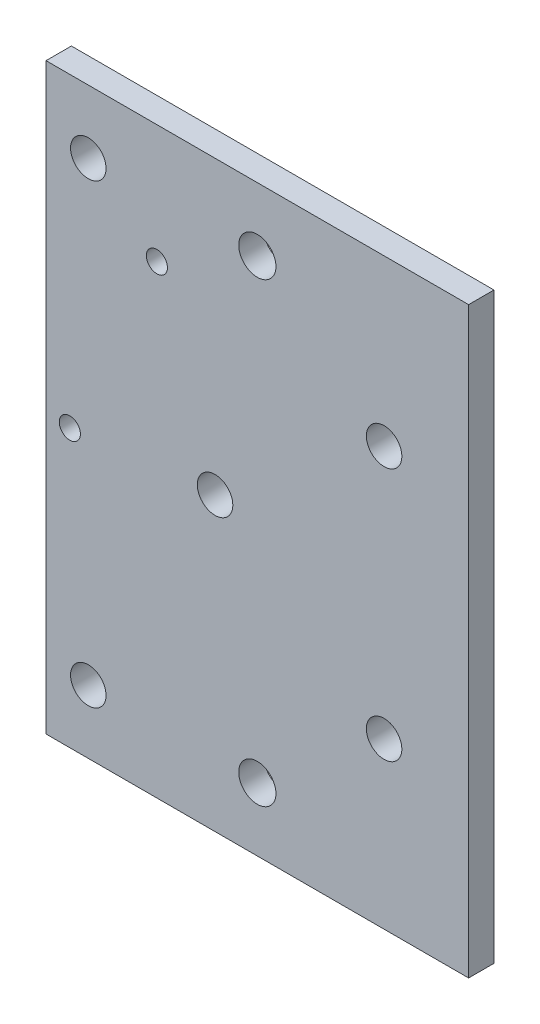
ISO-10303-21;
HEADER;
FILE_DESCRIPTION(('STEP AP214'),'2;1');
FILE_NAME('part.step','',(''),(''),'','','');
FILE_SCHEMA(('AUTOMOTIVE_DESIGN { 1 0 10303 214 1 1 1 1 }'));
ENDSEC;
DATA;
#1=APPLICATION_CONTEXT('core data for automotive mechanical design processes');
#2=APPLICATION_PROTOCOL_DEFINITION('international standard','automotive_design',2000,#1);
#3=PRODUCT_CONTEXT('',#1,'mechanical');
#4=PRODUCT('Part','Part','',(#3));
#5=PRODUCT_RELATED_PRODUCT_CATEGORY('part','',(#4));
#6=PRODUCT_DEFINITION_FORMATION('','',#4);
#7=PRODUCT_DEFINITION_CONTEXT('part definition',#1,'design');
#8=PRODUCT_DEFINITION('design','',#6,#7);
#9=PRODUCT_DEFINITION_SHAPE('','',#8);
#10=(LENGTH_UNIT() NAMED_UNIT(*) SI_UNIT(.MILLI.,.METRE.));
#11=(NAMED_UNIT(*) PLANE_ANGLE_UNIT() SI_UNIT($,.RADIAN.));
#12=(NAMED_UNIT(*) SI_UNIT($,.STERADIAN.) SOLID_ANGLE_UNIT());
#13=UNCERTAINTY_MEASURE_WITH_UNIT(LENGTH_MEASURE(1.E-05),#10,'distance_accuracy_value','');
#14=(GEOMETRIC_REPRESENTATION_CONTEXT(3) GLOBAL_UNCERTAINTY_ASSIGNED_CONTEXT((#13)) GLOBAL_UNIT_ASSIGNED_CONTEXT((#10,
#11,#12)) REPRESENTATION_CONTEXT('',''));
#15=CARTESIAN_POINT('',(0.,0.,0.));
#16=DIRECTION('',(0.,0.,1.));
#17=DIRECTION('',(1.,0.,0.));
#18=AXIS2_PLACEMENT_3D('',#15,#16,#17);
#19=CARTESIAN_POINT('',(0.,0.,3.));
#20=DIRECTION('',(0.,0.,1.));
#21=DIRECTION('',(1.,0.,0.));
#22=AXIS2_PLACEMENT_3D('',#19,#20,#21);
#23=PLANE('',#22);
#24=CARTESIAN_POINT('',(-25.,-27.,3.));
#25=DIRECTION('',(0.,0.,1.));
#26=DIRECTION('',(1.,0.,0.));
#27=AXIS2_PLACEMENT_3D('',#24,#25,#26);
#28=CIRCLE('',#27,2.1);
#29=CARTESIAN_POINT('',(-22.9,-27.,3.));
#30=VERTEX_POINT('',#29);
#31=EDGE_CURVE('E207',#30,#30,#28,.T.);
#32=ORIENTED_EDGE('',*,*,#31,.F.);
#33=EDGE_LOOP('',(#32));
#34=FACE_BOUND('',#33,.T.);
#35=CARTESIAN_POINT('',(-25.,27.,3.));
#36=DIRECTION('',(0.,0.,1.));
#37=DIRECTION('',(1.,0.,0.));
#38=AXIS2_PLACEMENT_3D('',#35,#36,#37);
#39=CIRCLE('',#38,2.1);
#40=CARTESIAN_POINT('',(-22.9,27.,3.));
#41=VERTEX_POINT('',#40);
#42=EDGE_CURVE('E211',#41,#41,#39,.T.);
#43=ORIENTED_EDGE('',*,*,#42,.F.);
#44=EDGE_LOOP('',(#43));
#45=FACE_BOUND('',#44,.T.);
#46=CARTESIAN_POINT('',(-16.8818880182161,20.46343837491,3.));
#47=DIRECTION('',(0.,0.,1.));
#48=DIRECTION('',(1.,0.,0.));
#49=AXIS2_PLACEMENT_3D('',#46,#47,#48);
#50=CIRCLE('',#49,1.24999999999999);
#51=CARTESIAN_POINT('',(-15.6318880182162,20.46343837491,3.));
#52=VERTEX_POINT('',#51);
#53=EDGE_CURVE('E220',#52,#52,#50,.T.);
#54=ORIENTED_EDGE('',*,*,#53,.F.);
#55=EDGE_LOOP('',(#54));
#56=FACE_BOUND('',#55,.T.);
#57=CARTESIAN_POINT('',(-27.1818880182186,-1.73656162508885,3.));
#58=DIRECTION('',(0.,0.,1.));
#59=DIRECTION('',(1.,0.,0.));
#60=AXIS2_PLACEMENT_3D('',#57,#58,#59);
#61=CIRCLE('',#60,1.24999999999999);
#62=CARTESIAN_POINT('',(-25.9318880182186,-1.73656162508885,3.));
#63=VERTEX_POINT('',#62);
#64=EDGE_CURVE('E226',#63,#63,#61,.T.);
#65=ORIENTED_EDGE('',*,*,#64,.F.);
#66=EDGE_LOOP('',(#65));
#67=FACE_BOUND('',#66,.T.);
#68=CARTESIAN_POINT('',(10.,-15.,3.));
#69=DIRECTION('',(0.,0.,1.));
#70=DIRECTION('',(1.,0.,0.));
#71=AXIS2_PLACEMENT_3D('',#68,#69,#70);
#72=CIRCLE('',#71,2.1);
#73=CARTESIAN_POINT('',(12.1,-15.,3.));
#74=VERTEX_POINT('',#73);
#75=EDGE_CURVE('E139',#74,#74,#72,.T.);
#76=ORIENTED_EDGE('',*,*,#75,.F.);
#77=EDGE_LOOP('',(#76));
#78=FACE_BOUND('',#77,.T.);
#79=CARTESIAN_POINT('',(10.,15.,3.));
#80=DIRECTION('',(0.,0.,1.));
#81=DIRECTION('',(1.,0.,0.));
#82=AXIS2_PLACEMENT_3D('',#79,#80,#81);
#83=CIRCLE('',#82,2.1);
#84=CARTESIAN_POINT('',(12.1,15.,3.));
#85=VERTEX_POINT('',#84);
#86=EDGE_CURVE('E134',#85,#85,#83,.T.);
#87=ORIENTED_EDGE('',*,*,#86,.F.);
#88=EDGE_LOOP('',(#87));
#89=FACE_BOUND('',#88,.T.);
#90=CARTESIAN_POINT('',(-9.99999999999999,0.,3.));
#91=DIRECTION('',(0.,0.,1.));
#92=DIRECTION('',(1.,0.,0.));
#93=AXIS2_PLACEMENT_3D('',#90,#91,#92);
#94=CIRCLE('',#93,2.1);
#95=CARTESIAN_POINT('',(-7.89999999999999,0.,3.));
#96=VERTEX_POINT('',#95);
#97=EDGE_CURVE('E142',#96,#96,#94,.T.);
#98=ORIENTED_EDGE('',*,*,#97,.F.);
#99=EDGE_LOOP('',(#98));
#100=FACE_BOUND('',#99,.T.);
#101=CARTESIAN_POINT('',(-5.,-27.,3.));
#102=DIRECTION('',(0.,0.,1.));
#103=DIRECTION('',(1.,0.,0.));
#104=AXIS2_PLACEMENT_3D('',#101,#102,#103);
#105=CIRCLE('',#104,2.2);
#106=CARTESIAN_POINT('',(-2.8,-27.,3.));
#107=VERTEX_POINT('',#106);
#108=EDGE_CURVE('E119',#107,#107,#105,.T.);
#109=ORIENTED_EDGE('',*,*,#108,.F.);
#110=EDGE_LOOP('',(#109));
#111=FACE_BOUND('',#110,.T.);
#112=CARTESIAN_POINT('',(-5.,27.,3.));
#113=DIRECTION('',(0.,0.,1.));
#114=DIRECTION('',(1.,0.,0.));
#115=AXIS2_PLACEMENT_3D('',#112,#113,#114);
#116=CIRCLE('',#115,2.2);
#117=CARTESIAN_POINT('',(-2.8,27.,3.));
#118=VERTEX_POINT('',#117);
#119=EDGE_CURVE('E108',#118,#118,#116,.T.);
#120=ORIENTED_EDGE('',*,*,#119,.F.);
#121=EDGE_LOOP('',(#120));
#122=FACE_BOUND('',#121,.T.);
#123=DIRECTION('',(1.,0.,0.));
#124=VECTOR('',#123,1.);
#125=CARTESIAN_POINT('',(-20.,34.5,3.));
#126=LINE('',#125,#124);
#127=CARTESIAN_POINT('',(-30.,34.5,3.));
#128=VERTEX_POINT('',#127);
#129=CARTESIAN_POINT('',(20.,34.5,3.));
#130=VERTEX_POINT('',#129);
#131=EDGE_CURVE('E92',#128,#130,#126,.T.);
#132=ORIENTED_EDGE('',*,*,#131,.F.);
#133=DIRECTION('',(0.,1.,0.));
#134=VECTOR('',#133,1.);
#135=CARTESIAN_POINT('',(-30.,-34.5,3.));
#136=LINE('',#135,#134);
#137=CARTESIAN_POINT('',(-30.,-34.5,3.));
#138=VERTEX_POINT('',#137);
#139=EDGE_CURVE('E78',#138,#128,#136,.T.);
#140=ORIENTED_EDGE('',*,*,#139,.F.);
#141=DIRECTION('',(-1.,0.,0.));
#142=VECTOR('',#141,1.);
#143=CARTESIAN_POINT('',(20.,-34.5,3.));
#144=LINE('',#143,#142);
#145=CARTESIAN_POINT('',(20.,-34.5,3.));
#146=VERTEX_POINT('',#145);
#147=EDGE_CURVE('E100',#146,#138,#144,.T.);
#148=ORIENTED_EDGE('',*,*,#147,.F.);
#149=DIRECTION('',(0.,1.,0.));
#150=VECTOR('',#149,1.);
#151=CARTESIAN_POINT('',(20.,14.5,3.));
#152=LINE('',#151,#150);
#153=EDGE_CURVE('E11',#146,#130,#152,.T.);
#154=ORIENTED_EDGE('',*,*,#153,.T.);
#155=EDGE_LOOP('',(#132,#140,#148,#154));
#156=FACE_BOUND('',#155,.T.);
#157=ADVANCED_FACE('F36',(#34,#45,#56,#67,#78,#89,#100,#111,#122,#156),#23,.T.);
#158=CARTESIAN_POINT('',(0.,0.,0.));
#159=DIRECTION('',(0.,0.,1.));
#160=DIRECTION('',(1.,0.,0.));
#161=AXIS2_PLACEMENT_3D('',#158,#159,#160);
#162=PLANE('',#161);
#163=CARTESIAN_POINT('',(-25.,-27.,0.));
#164=DIRECTION('',(0.,0.,-1.));
#165=DIRECTION('',(-1.,0.,0.));
#166=AXIS2_PLACEMENT_3D('',#163,#164,#165);
#167=CIRCLE('',#166,2.1);
#168=CARTESIAN_POINT('',(-27.1,-27.,0.));
#169=VERTEX_POINT('',#168);
#170=EDGE_CURVE('E210',#169,#169,#167,.T.);
#171=ORIENTED_EDGE('',*,*,#170,.F.);
#172=EDGE_LOOP('',(#171));
#173=FACE_BOUND('',#172,.T.);
#174=CARTESIAN_POINT('',(-25.,27.,0.));
#175=DIRECTION('',(0.,0.,-1.));
#176=DIRECTION('',(-1.,0.,0.));
#177=AXIS2_PLACEMENT_3D('',#174,#175,#176);
#178=CIRCLE('',#177,2.1);
#179=CARTESIAN_POINT('',(-27.1,27.,0.));
#180=VERTEX_POINT('',#179);
#181=EDGE_CURVE('E212',#180,#180,#178,.T.);
#182=ORIENTED_EDGE('',*,*,#181,.F.);
#183=EDGE_LOOP('',(#182));
#184=FACE_BOUND('',#183,.T.);
#185=CARTESIAN_POINT('',(-16.8818880182161,20.46343837491,0.));
#186=DIRECTION('',(0.,0.,1.));
#187=DIRECTION('',(1.,0.,0.));
#188=AXIS2_PLACEMENT_3D('',#185,#186,#187);
#189=CIRCLE('',#188,1.24999999999999);
#190=CARTESIAN_POINT('',(-15.6318880182162,20.46343837491,0.));
#191=VERTEX_POINT('',#190);
#192=EDGE_CURVE('E223',#191,#191,#189,.T.);
#193=ORIENTED_EDGE('',*,*,#192,.T.);
#194=EDGE_LOOP('',(#193));
#195=FACE_BOUND('',#194,.T.);
#196=CARTESIAN_POINT('',(-27.1818880182186,-1.73656162508885,0.));
#197=DIRECTION('',(0.,0.,1.));
#198=DIRECTION('',(1.,0.,0.));
#199=AXIS2_PLACEMENT_3D('',#196,#197,#198);
#200=CIRCLE('',#199,1.24999999999999);
#201=CARTESIAN_POINT('',(-25.9318880182186,-1.73656162508885,0.));
#202=VERTEX_POINT('',#201);
#203=EDGE_CURVE('E87',#202,#202,#200,.T.);
#204=ORIENTED_EDGE('',*,*,#203,.T.);
#205=EDGE_LOOP('',(#204));
#206=FACE_BOUND('',#205,.T.);
#207=CARTESIAN_POINT('',(-5.,27.,0.));
#208=DIRECTION('',(0.,0.,1.));
#209=DIRECTION('',(1.,0.,0.));
#210=AXIS2_PLACEMENT_3D('',#207,#208,#209);
#211=CIRCLE('',#210,2.2);
#212=CARTESIAN_POINT('',(-2.8,27.,0.));
#213=VERTEX_POINT('',#212);
#214=EDGE_CURVE('E105',#213,#213,#211,.T.);
#215=ORIENTED_EDGE('',*,*,#214,.T.);
#216=EDGE_LOOP('',(#215));
#217=FACE_BOUND('',#216,.T.);
#218=CARTESIAN_POINT('',(-5.,-27.,0.));
#219=DIRECTION('',(0.,0.,1.));
#220=DIRECTION('',(1.,0.,0.));
#221=AXIS2_PLACEMENT_3D('',#218,#219,#220);
#222=CIRCLE('',#221,2.2);
#223=CARTESIAN_POINT('',(-2.8,-27.,0.));
#224=VERTEX_POINT('',#223);
#225=EDGE_CURVE('E114',#224,#224,#222,.T.);
#226=ORIENTED_EDGE('',*,*,#225,.T.);
#227=EDGE_LOOP('',(#226));
#228=FACE_BOUND('',#227,.T.);
#229=CARTESIAN_POINT('',(-9.99999999999999,0.,0.));
#230=DIRECTION('',(0.,0.,1.));
#231=DIRECTION('',(1.,0.,0.));
#232=AXIS2_PLACEMENT_3D('',#229,#230,#231);
#233=CIRCLE('',#232,2.1);
#234=CARTESIAN_POINT('',(-7.89999999999999,0.,0.));
#235=VERTEX_POINT('',#234);
#236=EDGE_CURVE('E40',#235,#235,#233,.T.);
#237=ORIENTED_EDGE('',*,*,#236,.T.);
#238=EDGE_LOOP('',(#237));
#239=FACE_BOUND('',#238,.T.);
#240=CARTESIAN_POINT('',(10.,15.,0.));
#241=DIRECTION('',(0.,0.,-1.));
#242=DIRECTION('',(-1.,0.,0.));
#243=AXIS2_PLACEMENT_3D('',#240,#241,#242);
#244=CIRCLE('',#243,2.1);
#245=CARTESIAN_POINT('',(7.9,15.,0.));
#246=VERTEX_POINT('',#245);
#247=EDGE_CURVE('E128',#246,#246,#244,.T.);
#248=ORIENTED_EDGE('',*,*,#247,.F.);
#249=EDGE_LOOP('',(#248));
#250=FACE_BOUND('',#249,.T.);
#251=CARTESIAN_POINT('',(10.,-15.,0.));
#252=DIRECTION('',(0.,0.,-1.));
#253=DIRECTION('',(-1.,0.,0.));
#254=AXIS2_PLACEMENT_3D('',#251,#252,#253);
#255=CIRCLE('',#254,2.1);
#256=CARTESIAN_POINT('',(7.9,-15.,0.));
#257=VERTEX_POINT('',#256);
#258=EDGE_CURVE('E131',#257,#257,#255,.T.);
#259=ORIENTED_EDGE('',*,*,#258,.F.);
#260=EDGE_LOOP('',(#259));
#261=FACE_BOUND('',#260,.T.);
#262=DIRECTION('',(0.,-1.,0.));
#263=VECTOR('',#262,1.);
#264=CARTESIAN_POINT('',(-30.,-34.5,0.));
#265=LINE('',#264,#263);
#266=CARTESIAN_POINT('',(-30.,34.5,0.));
#267=VERTEX_POINT('',#266);
#268=CARTESIAN_POINT('',(-30.,-34.5,0.));
#269=VERTEX_POINT('',#268);
#270=EDGE_CURVE('E53',#267,#269,#265,.T.);
#271=ORIENTED_EDGE('',*,*,#270,.F.);
#272=DIRECTION('',(-1.,0.,0.));
#273=VECTOR('',#272,1.);
#274=CARTESIAN_POINT('',(-20.,34.5,0.));
#275=LINE('',#274,#273);
#276=CARTESIAN_POINT('',(20.,34.5,0.));
#277=VERTEX_POINT('',#276);
#278=EDGE_CURVE('E94',#277,#267,#275,.T.);
#279=ORIENTED_EDGE('',*,*,#278,.F.);
#280=DIRECTION('',(0.,1.,0.));
#281=VECTOR('',#280,1.);
#282=CARTESIAN_POINT('',(20.,14.5,0.));
#283=LINE('',#282,#281);
#284=CARTESIAN_POINT('',(20.,-34.5,0.));
#285=VERTEX_POINT('',#284);
#286=EDGE_CURVE('E45',#285,#277,#283,.T.);
#287=ORIENTED_EDGE('',*,*,#286,.F.);
#288=DIRECTION('',(1.,0.,0.));
#289=VECTOR('',#288,1.);
#290=CARTESIAN_POINT('',(20.,-34.5,0.));
#291=LINE('',#290,#289);
#292=EDGE_CURVE('E97',#269,#285,#291,.T.);
#293=ORIENTED_EDGE('',*,*,#292,.F.);
#294=EDGE_LOOP('',(#271,#279,#287,#293));
#295=FACE_BOUND('',#294,.T.);
#296=ADVANCED_FACE('F126',(#173,#184,#195,#206,#217,#228,#239,#250,#261,#295),#162,.F.);
#297=CARTESIAN_POINT('',(0.,34.5,0.));
#298=DIRECTION('',(0.,-1.,0.));
#299=DIRECTION('',(0.,0.,-1.));
#300=AXIS2_PLACEMENT_3D('',#297,#298,#299);
#301=PLANE('',#300);
#302=DIRECTION('',(0.,0.,-1.));
#303=VECTOR('',#302,1.);
#304=CARTESIAN_POINT('',(-30.,34.5,3.));
#305=LINE('',#304,#303);
#306=EDGE_CURVE('E81',#128,#267,#305,.T.);
#307=ORIENTED_EDGE('',*,*,#306,.F.);
#308=ORIENTED_EDGE('',*,*,#131,.T.);
#309=DIRECTION('',(0.,0.,-1.));
#310=VECTOR('',#309,1.);
#311=CARTESIAN_POINT('',(20.,34.5,3.));
#312=LINE('',#311,#310);
#313=EDGE_CURVE('E96',#130,#277,#312,.T.);
#314=ORIENTED_EDGE('',*,*,#313,.T.);
#315=ORIENTED_EDGE('',*,*,#278,.T.);
#316=EDGE_LOOP('',(#307,#308,#314,#315));
#317=FACE_BOUND('',#316,.T.);
#318=ADVANCED_FACE('F91',(#317),#301,.F.);
#319=CARTESIAN_POINT('',(0.,-34.5,0.));
#320=DIRECTION('',(0.,1.,0.));
#321=DIRECTION('',(0.,0.,1.));
#322=AXIS2_PLACEMENT_3D('',#319,#320,#321);
#323=PLANE('',#322);
#324=DIRECTION('',(0.,0.,1.));
#325=VECTOR('',#324,1.);
#326=CARTESIAN_POINT('',(-30.,-34.5,3.));
#327=LINE('',#326,#325);
#328=EDGE_CURVE('E82',#269,#138,#327,.T.);
#329=ORIENTED_EDGE('',*,*,#328,.F.);
#330=ORIENTED_EDGE('',*,*,#292,.T.);
#331=DIRECTION('',(0.,0.,1.));
#332=VECTOR('',#331,1.);
#333=CARTESIAN_POINT('',(20.,-34.5,3.));
#334=LINE('',#333,#332);
#335=EDGE_CURVE('E107',#285,#146,#334,.T.);
#336=ORIENTED_EDGE('',*,*,#335,.T.);
#337=ORIENTED_EDGE('',*,*,#147,.T.);
#338=EDGE_LOOP('',(#329,#330,#336,#337));
#339=FACE_BOUND('',#338,.T.);
#340=ADVANCED_FACE('F123',(#339),#323,.F.);
#341=CARTESIAN_POINT('',(20.,14.5,3.));
#342=DIRECTION('',(-1.,0.,0.));
#343=DIRECTION('',(0.,-1.,0.));
#344=AXIS2_PLACEMENT_3D('',#341,#342,#343);
#345=PLANE('',#344);
#346=ORIENTED_EDGE('',*,*,#286,.T.);
#347=ORIENTED_EDGE('',*,*,#313,.F.);
#348=ORIENTED_EDGE('',*,*,#153,.F.);
#349=ORIENTED_EDGE('',*,*,#335,.F.);
#350=EDGE_LOOP('',(#346,#347,#348,#349));
#351=FACE_BOUND('',#350,.T.);
#352=ADVANCED_FACE('F38',(#351),#345,.F.);
#353=CARTESIAN_POINT('',(-5.,27.,-12.));
#354=DIRECTION('',(0.,0.,1.));
#355=DIRECTION('',(1.,0.,0.));
#356=AXIS2_PLACEMENT_3D('',#353,#354,#355);
#357=CYLINDRICAL_SURFACE('',#356,2.2);
#358=ORIENTED_EDGE('',*,*,#119,.T.);
#359=EDGE_LOOP('',(#358));
#360=FACE_BOUND('',#359,.T.);
#361=ORIENTED_EDGE('',*,*,#214,.F.);
#362=EDGE_LOOP('',(#361));
#363=FACE_BOUND('',#362,.T.);
#364=ADVANCED_FACE('F169',(#360,#363),#357,.F.);
#365=CARTESIAN_POINT('',(-5.,-27.,0.));
#366=DIRECTION('',(0.,0.,1.));
#367=DIRECTION('',(1.,0.,0.));
#368=AXIS2_PLACEMENT_3D('',#365,#366,#367);
#369=CYLINDRICAL_SURFACE('',#368,2.2);
#370=ORIENTED_EDGE('',*,*,#225,.F.);
#371=EDGE_LOOP('',(#370));
#372=FACE_BOUND('',#371,.T.);
#373=ORIENTED_EDGE('',*,*,#108,.T.);
#374=EDGE_LOOP('',(#373));
#375=FACE_BOUND('',#374,.T.);
#376=ADVANCED_FACE('F152',(#372,#375),#369,.F.);
#377=CARTESIAN_POINT('',(-9.99999999999999,0.,-7.));
#378=DIRECTION('',(0.,0.,1.));
#379=DIRECTION('',(1.,0.,0.));
#380=AXIS2_PLACEMENT_3D('',#377,#378,#379);
#381=CYLINDRICAL_SURFACE('',#380,2.1);
#382=ORIENTED_EDGE('',*,*,#97,.T.);
#383=EDGE_LOOP('',(#382));
#384=FACE_BOUND('',#383,.T.);
#385=ORIENTED_EDGE('',*,*,#236,.F.);
#386=EDGE_LOOP('',(#385));
#387=FACE_BOUND('',#386,.T.);
#388=ADVANCED_FACE('F174',(#384,#387),#381,.F.);
#389=CARTESIAN_POINT('',(10.,15.,10.));
#390=DIRECTION('',(0.,0.,-1.));
#391=DIRECTION('',(-1.,0.,0.));
#392=AXIS2_PLACEMENT_3D('',#389,#390,#391);
#393=CYLINDRICAL_SURFACE('',#392,2.1);
#394=ORIENTED_EDGE('',*,*,#86,.T.);
#395=EDGE_LOOP('',(#394));
#396=FACE_BOUND('',#395,.T.);
#397=ORIENTED_EDGE('',*,*,#247,.T.);
#398=EDGE_LOOP('',(#397));
#399=FACE_BOUND('',#398,.T.);
#400=ADVANCED_FACE('F178',(#396,#399),#393,.F.);
#401=CARTESIAN_POINT('',(10.,-15.,10.));
#402=DIRECTION('',(0.,0.,-1.));
#403=DIRECTION('',(-1.,0.,0.));
#404=AXIS2_PLACEMENT_3D('',#401,#402,#403);
#405=CYLINDRICAL_SURFACE('',#404,2.1);
#406=ORIENTED_EDGE('',*,*,#75,.T.);
#407=EDGE_LOOP('',(#406));
#408=FACE_BOUND('',#407,.T.);
#409=ORIENTED_EDGE('',*,*,#258,.T.);
#410=EDGE_LOOP('',(#409));
#411=FACE_BOUND('',#410,.T.);
#412=ADVANCED_FACE('F181',(#408,#411),#405,.F.);
#413=CARTESIAN_POINT('',(-30.,0.,0.));
#414=DIRECTION('',(-1.,0.,0.));
#415=DIRECTION('',(0.,-1.,0.));
#416=AXIS2_PLACEMENT_3D('',#413,#414,#415);
#417=PLANE('',#416);
#418=ORIENTED_EDGE('',*,*,#139,.T.);
#419=ORIENTED_EDGE('',*,*,#306,.T.);
#420=ORIENTED_EDGE('',*,*,#270,.T.);
#421=ORIENTED_EDGE('',*,*,#328,.T.);
#422=EDGE_LOOP('',(#418,#419,#420,#421));
#423=FACE_BOUND('',#422,.T.);
#424=ADVANCED_FACE('F80',(#423),#417,.T.);
#425=CARTESIAN_POINT('',(-27.1818880182186,-1.73656162508885,3.));
#426=DIRECTION('',(0.,0.,1.));
#427=DIRECTION('',(1.,0.,0.));
#428=AXIS2_PLACEMENT_3D('',#425,#426,#427);
#429=CYLINDRICAL_SURFACE('',#428,1.24999999999999);
#430=ORIENTED_EDGE('',*,*,#64,.T.);
#431=EDGE_LOOP('',(#430));
#432=FACE_BOUND('',#431,.T.);
#433=ORIENTED_EDGE('',*,*,#203,.F.);
#434=EDGE_LOOP('',(#433));
#435=FACE_BOUND('',#434,.T.);
#436=ADVANCED_FACE('F188',(#432,#435),#429,.F.);
#437=CARTESIAN_POINT('',(-16.8818880182161,20.46343837491,3.));
#438=DIRECTION('',(0.,0.,1.));
#439=DIRECTION('',(1.,0.,0.));
#440=AXIS2_PLACEMENT_3D('',#437,#438,#439);
#441=CYLINDRICAL_SURFACE('',#440,1.24999999999999);
#442=ORIENTED_EDGE('',*,*,#53,.T.);
#443=EDGE_LOOP('',(#442));
#444=FACE_BOUND('',#443,.T.);
#445=ORIENTED_EDGE('',*,*,#192,.F.);
#446=EDGE_LOOP('',(#445));
#447=FACE_BOUND('',#446,.T.);
#448=ADVANCED_FACE('F191',(#444,#447),#441,.F.);
#449=CARTESIAN_POINT('',(-25.,27.,10.));
#450=DIRECTION('',(0.,0.,-1.));
#451=DIRECTION('',(-1.,0.,0.));
#452=AXIS2_PLACEMENT_3D('',#449,#450,#451);
#453=CYLINDRICAL_SURFACE('',#452,2.1);
#454=ORIENTED_EDGE('',*,*,#42,.T.);
#455=EDGE_LOOP('',(#454));
#456=FACE_BOUND('',#455,.T.);
#457=ORIENTED_EDGE('',*,*,#181,.T.);
#458=EDGE_LOOP('',(#457));
#459=FACE_BOUND('',#458,.T.);
#460=ADVANCED_FACE('F195',(#456,#459),#453,.F.);
#461=CARTESIAN_POINT('',(-25.,-27.,10.));
#462=DIRECTION('',(0.,0.,-1.));
#463=DIRECTION('',(-1.,0.,0.));
#464=AXIS2_PLACEMENT_3D('',#461,#462,#463);
#465=CYLINDRICAL_SURFACE('',#464,2.1);
#466=ORIENTED_EDGE('',*,*,#31,.T.);
#467=EDGE_LOOP('',(#466));
#468=FACE_BOUND('',#467,.T.);
#469=ORIENTED_EDGE('',*,*,#170,.T.);
#470=EDGE_LOOP('',(#469));
#471=FACE_BOUND('',#470,.T.);
#472=ADVANCED_FACE('F199',(#468,#471),#465,.F.);
#473=CLOSED_SHELL('',(#157,#296,#318,#340,#352,#364,#376,#388,#400,#412,#424,#436,#448,#460,#472));
#474=MANIFOLD_SOLID_BREP('B2',#473);
#475=ADVANCED_BREP_SHAPE_REPRESENTATION('',(#18,#474),#14);
#476=SHAPE_DEFINITION_REPRESENTATION(#9,#475);
ENDSEC;
END-ISO-10303-21;
